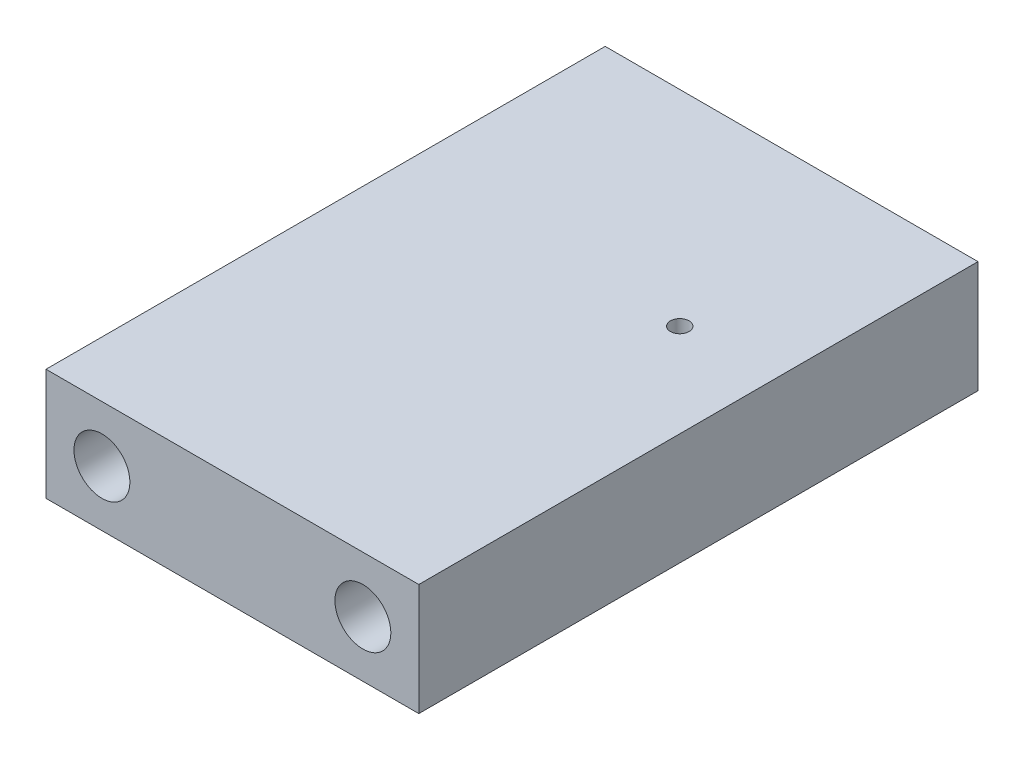
ISO-10303-21;
HEADER;
FILE_DESCRIPTION(('STEP AP214'),'2;1');
FILE_NAME('part.step','',(''),(''),'','','');
FILE_SCHEMA(('AUTOMOTIVE_DESIGN { 1 0 10303 214 1 1 1 1 }'));
ENDSEC;
DATA;
#1=APPLICATION_CONTEXT('core data for automotive mechanical design processes');
#2=APPLICATION_PROTOCOL_DEFINITION('international standard','automotive_design',2000,#1);
#3=PRODUCT_CONTEXT('',#1,'mechanical');
#4=PRODUCT('Part','Part','',(#3));
#5=PRODUCT_RELATED_PRODUCT_CATEGORY('part','',(#4));
#6=PRODUCT_DEFINITION_FORMATION('','',#4);
#7=PRODUCT_DEFINITION_CONTEXT('part definition',#1,'design');
#8=PRODUCT_DEFINITION('design','',#6,#7);
#9=PRODUCT_DEFINITION_SHAPE('','',#8);
#10=(LENGTH_UNIT() NAMED_UNIT(*) SI_UNIT(.MILLI.,.METRE.));
#11=(NAMED_UNIT(*) PLANE_ANGLE_UNIT() SI_UNIT($,.RADIAN.));
#12=(NAMED_UNIT(*) SI_UNIT($,.STERADIAN.) SOLID_ANGLE_UNIT());
#13=UNCERTAINTY_MEASURE_WITH_UNIT(LENGTH_MEASURE(1.E-05),#10,'distance_accuracy_value','');
#14=(GEOMETRIC_REPRESENTATION_CONTEXT(3) GLOBAL_UNCERTAINTY_ASSIGNED_CONTEXT((#13)) GLOBAL_UNIT_ASSIGNED_CONTEXT((#10,
#11,#12)) REPRESENTATION_CONTEXT('',''));
#15=CARTESIAN_POINT('',(0.,0.,0.));
#16=DIRECTION('',(0.,0.,1.));
#17=DIRECTION('',(1.,0.,0.));
#18=AXIS2_PLACEMENT_3D('',#15,#16,#17);
#19=CARTESIAN_POINT('',(0.,0.,30.));
#20=DIRECTION('',(1.,0.,0.));
#21=DIRECTION('',(0.,0.,-1.));
#22=AXIS2_PLACEMENT_3D('',#19,#20,#21);
#23=PLANE('',#22);
#24=DIRECTION('',(0.,-1.,0.));
#25=VECTOR('',#24,1.);
#26=CARTESIAN_POINT('',(0.,0.,0.));
#27=LINE('',#26,#25);
#28=CARTESIAN_POINT('',(0.,6.,0.));
#29=VERTEX_POINT('',#28);
#30=CARTESIAN_POINT('',(0.,0.,0.));
#31=VERTEX_POINT('',#30);
#32=EDGE_CURVE('E96',#29,#31,#27,.T.);
#33=ORIENTED_EDGE('',*,*,#32,.T.);
#34=DIRECTION('',(0.,0.,-1.));
#35=VECTOR('',#34,1.);
#36=CARTESIAN_POINT('',(0.,0.,30.));
#37=LINE('',#36,#35);
#38=CARTESIAN_POINT('',(0.,0.,30.));
#39=VERTEX_POINT('',#38);
#40=EDGE_CURVE('E11',#39,#31,#37,.T.);
#41=ORIENTED_EDGE('',*,*,#40,.F.);
#42=DIRECTION('',(0.,-1.,0.));
#43=VECTOR('',#42,1.);
#44=CARTESIAN_POINT('',(0.,0.,30.));
#45=LINE('',#44,#43);
#46=CARTESIAN_POINT('',(0.,6.,30.));
#47=VERTEX_POINT('',#46);
#48=EDGE_CURVE('E84',#47,#39,#45,.T.);
#49=ORIENTED_EDGE('',*,*,#48,.F.);
#50=DIRECTION('',(0.,0.,-1.));
#51=VECTOR('',#50,1.);
#52=CARTESIAN_POINT('',(0.,6.,30.));
#53=LINE('',#52,#51);
#54=EDGE_CURVE('E92',#47,#29,#53,.T.);
#55=ORIENTED_EDGE('',*,*,#54,.T.);
#56=EDGE_LOOP('',(#33,#41,#49,#55));
#57=FACE_BOUND('',#56,.T.);
#58=ADVANCED_FACE('F33',(#57),#23,.F.);
#59=CARTESIAN_POINT('',(0.,0.,30.));
#60=DIRECTION('',(0.,1.,0.));
#61=DIRECTION('',(0.,0.,1.));
#62=AXIS2_PLACEMENT_3D('',#59,#60,#61);
#63=PLANE('',#62);
#64=CARTESIAN_POINT('',(15.,0.,11.));
#65=DIRECTION('',(0.,1.,0.));
#66=DIRECTION('',(0.,0.,1.));
#67=AXIS2_PLACEMENT_3D('',#64,#65,#66);
#68=CIRCLE('',#67,0.500000000000001);
#69=CARTESIAN_POINT('',(15.,0.,11.5));
#70=VERTEX_POINT('',#69);
#71=EDGE_CURVE('E131',#70,#70,#68,.T.);
#72=ORIENTED_EDGE('',*,*,#71,.T.);
#73=EDGE_LOOP('',(#72));
#74=FACE_BOUND('',#73,.T.);
#75=DIRECTION('',(1.,0.,0.));
#76=VECTOR('',#75,1.);
#77=CARTESIAN_POINT('',(0.,0.,0.));
#78=LINE('',#77,#76);
#79=CARTESIAN_POINT('',(20.,0.,0.));
#80=VERTEX_POINT('',#79);
#81=EDGE_CURVE('E88',#31,#80,#78,.T.);
#82=ORIENTED_EDGE('',*,*,#81,.T.);
#83=DIRECTION('',(0.,0.,-1.));
#84=VECTOR('',#83,1.);
#85=CARTESIAN_POINT('',(20.,0.,30.));
#86=LINE('',#85,#84);
#87=CARTESIAN_POINT('',(20.,0.,30.));
#88=VERTEX_POINT('',#87);
#89=EDGE_CURVE('E41',#88,#80,#86,.T.);
#90=ORIENTED_EDGE('',*,*,#89,.F.);
#91=DIRECTION('',(1.,0.,0.));
#92=VECTOR('',#91,1.);
#93=CARTESIAN_POINT('',(0.,0.,30.));
#94=LINE('',#93,#92);
#95=EDGE_CURVE('E79',#39,#88,#94,.T.);
#96=ORIENTED_EDGE('',*,*,#95,.F.);
#97=ORIENTED_EDGE('',*,*,#40,.T.);
#98=EDGE_LOOP('',(#82,#90,#96,#97));
#99=FACE_BOUND('',#98,.T.);
#100=ADVANCED_FACE('F87',(#74,#99),#63,.F.);
#101=CARTESIAN_POINT('',(20.,0.,30.));
#102=DIRECTION('',(-1.,0.,0.));
#103=DIRECTION('',(0.,0.,1.));
#104=AXIS2_PLACEMENT_3D('',#101,#102,#103);
#105=PLANE('',#104);
#106=DIRECTION('',(0.,1.,0.));
#107=VECTOR('',#106,1.);
#108=CARTESIAN_POINT('',(20.,0.,0.));
#109=LINE('',#108,#107);
#110=CARTESIAN_POINT('',(20.,6.,0.));
#111=VERTEX_POINT('',#110);
#112=EDGE_CURVE('E66',#80,#111,#109,.T.);
#113=ORIENTED_EDGE('',*,*,#112,.T.);
#114=DIRECTION('',(0.,0.,-1.));
#115=VECTOR('',#114,1.);
#116=CARTESIAN_POINT('',(20.,6.,30.));
#117=LINE('',#116,#115);
#118=CARTESIAN_POINT('',(20.,6.,30.));
#119=VERTEX_POINT('',#118);
#120=EDGE_CURVE('E89',#119,#111,#117,.T.);
#121=ORIENTED_EDGE('',*,*,#120,.F.);
#122=DIRECTION('',(0.,1.,0.));
#123=VECTOR('',#122,1.);
#124=CARTESIAN_POINT('',(20.,0.,30.));
#125=LINE('',#124,#123);
#126=EDGE_CURVE('E82',#88,#119,#125,.T.);
#127=ORIENTED_EDGE('',*,*,#126,.F.);
#128=ORIENTED_EDGE('',*,*,#89,.T.);
#129=EDGE_LOOP('',(#113,#121,#127,#128));
#130=FACE_BOUND('',#129,.T.);
#131=ADVANCED_FACE('F90',(#130),#105,.F.);
#132=CARTESIAN_POINT('',(0.,6.,30.));
#133=DIRECTION('',(0.,-1.,0.));
#134=DIRECTION('',(0.,0.,-1.));
#135=AXIS2_PLACEMENT_3D('',#132,#133,#134);
#136=PLANE('',#135);
#137=CARTESIAN_POINT('',(15.,6.,11.));
#138=DIRECTION('',(0.,1.,0.));
#139=DIRECTION('',(0.,0.,1.));
#140=AXIS2_PLACEMENT_3D('',#137,#138,#139);
#141=CIRCLE('',#140,0.500000000000001);
#142=CARTESIAN_POINT('',(15.,6.,11.5));
#143=VERTEX_POINT('',#142);
#144=EDGE_CURVE('E136',#143,#143,#141,.T.);
#145=ORIENTED_EDGE('',*,*,#144,.F.);
#146=EDGE_LOOP('',(#145));
#147=FACE_BOUND('',#146,.T.);
#148=DIRECTION('',(-1.,0.,0.));
#149=VECTOR('',#148,1.);
#150=CARTESIAN_POINT('',(0.,6.,0.));
#151=LINE('',#150,#149);
#152=EDGE_CURVE('E72',#111,#29,#151,.T.);
#153=ORIENTED_EDGE('',*,*,#152,.T.);
#154=ORIENTED_EDGE('',*,*,#54,.F.);
#155=DIRECTION('',(-1.,0.,0.));
#156=VECTOR('',#155,1.);
#157=CARTESIAN_POINT('',(0.,6.,30.));
#158=LINE('',#157,#156);
#159=EDGE_CURVE('E49',#119,#47,#158,.T.);
#160=ORIENTED_EDGE('',*,*,#159,.F.);
#161=ORIENTED_EDGE('',*,*,#120,.T.);
#162=EDGE_LOOP('',(#153,#154,#160,#161));
#163=FACE_BOUND('',#162,.T.);
#164=ADVANCED_FACE('F104',(#147,#163),#136,.F.);
#165=CARTESIAN_POINT('',(0.,0.,30.));
#166=DIRECTION('',(0.,0.,-1.));
#167=DIRECTION('',(-1.,0.,0.));
#168=AXIS2_PLACEMENT_3D('',#165,#166,#167);
#169=PLANE('',#168);
#170=CARTESIAN_POINT('',(17.,3.,30.));
#171=DIRECTION('',(0.,0.,1.));
#172=DIRECTION('',(1.,0.,0.));
#173=AXIS2_PLACEMENT_3D('',#170,#171,#172);
#174=CIRCLE('',#173,1.5);
#175=CARTESIAN_POINT('',(18.5,3.,30.));
#176=VERTEX_POINT('',#175);
#177=EDGE_CURVE('E116',#176,#176,#174,.T.);
#178=ORIENTED_EDGE('',*,*,#177,.F.);
#179=EDGE_LOOP('',(#178));
#180=FACE_BOUND('',#179,.T.);
#181=CARTESIAN_POINT('',(3.,3.,30.));
#182=DIRECTION('',(0.,0.,1.));
#183=DIRECTION('',(1.,0.,0.));
#184=AXIS2_PLACEMENT_3D('',#181,#182,#183);
#185=CIRCLE('',#184,1.5);
#186=CARTESIAN_POINT('',(4.5,3.,30.));
#187=VERTEX_POINT('',#186);
#188=EDGE_CURVE('E110',#187,#187,#185,.T.);
#189=ORIENTED_EDGE('',*,*,#188,.F.);
#190=EDGE_LOOP('',(#189));
#191=FACE_BOUND('',#190,.T.);
#192=ORIENTED_EDGE('',*,*,#48,.T.);
#193=ORIENTED_EDGE('',*,*,#95,.T.);
#194=ORIENTED_EDGE('',*,*,#126,.T.);
#195=ORIENTED_EDGE('',*,*,#159,.T.);
#196=EDGE_LOOP('',(#192,#193,#194,#195));
#197=FACE_BOUND('',#196,.T.);
#198=ADVANCED_FACE('F80',(#180,#191,#197),#169,.F.);
#199=CARTESIAN_POINT('',(0.,0.,0.));
#200=DIRECTION('',(0.,0.,-1.));
#201=DIRECTION('',(-1.,0.,0.));
#202=AXIS2_PLACEMENT_3D('',#199,#200,#201);
#203=PLANE('',#202);
#204=CARTESIAN_POINT('',(3.,3.,0.));
#205=DIRECTION('',(0.,0.,-1.));
#206=DIRECTION('',(-1.,0.,0.));
#207=AXIS2_PLACEMENT_3D('',#204,#205,#206);
#208=CIRCLE('',#207,1.5);
#209=CARTESIAN_POINT('',(1.5,3.,0.));
#210=VERTEX_POINT('',#209);
#211=EDGE_CURVE('E128',#210,#210,#208,.T.);
#212=ORIENTED_EDGE('',*,*,#211,.F.);
#213=EDGE_LOOP('',(#212));
#214=FACE_BOUND('',#213,.T.);
#215=CARTESIAN_POINT('',(17.,3.,0.));
#216=DIRECTION('',(0.,0.,-1.));
#217=DIRECTION('',(-1.,0.,0.));
#218=AXIS2_PLACEMENT_3D('',#215,#216,#217);
#219=CIRCLE('',#218,1.5);
#220=CARTESIAN_POINT('',(15.5,3.,0.));
#221=VERTEX_POINT('',#220);
#222=EDGE_CURVE('E122',#221,#221,#219,.T.);
#223=ORIENTED_EDGE('',*,*,#222,.F.);
#224=EDGE_LOOP('',(#223));
#225=FACE_BOUND('',#224,.T.);
#226=ORIENTED_EDGE('',*,*,#32,.F.);
#227=ORIENTED_EDGE('',*,*,#152,.F.);
#228=ORIENTED_EDGE('',*,*,#112,.F.);
#229=ORIENTED_EDGE('',*,*,#81,.F.);
#230=EDGE_LOOP('',(#226,#227,#228,#229));
#231=FACE_BOUND('',#230,.T.);
#232=ADVANCED_FACE('F107',(#214,#225,#231),#203,.T.);
#233=CARTESIAN_POINT('',(3.,3.,25.));
#234=DIRECTION('',(0.,0.,1.));
#235=DIRECTION('',(1.,0.,0.));
#236=AXIS2_PLACEMENT_3D('',#233,#234,#235);
#237=CYLINDRICAL_SURFACE('',#236,1.5);
#238=CARTESIAN_POINT('',(3.,3.,25.));
#239=DIRECTION('',(0.,0.,1.));
#240=DIRECTION('',(1.,0.,0.));
#241=AXIS2_PLACEMENT_3D('',#238,#239,#240);
#242=CIRCLE('',#241,1.5);
#243=CARTESIAN_POINT('',(4.5,3.,25.));
#244=VERTEX_POINT('',#243);
#245=EDGE_CURVE('E99',#244,#244,#242,.T.);
#246=ORIENTED_EDGE('',*,*,#245,.F.);
#247=EDGE_LOOP('',(#246));
#248=FACE_BOUND('',#247,.T.);
#249=ORIENTED_EDGE('',*,*,#188,.T.);
#250=EDGE_LOOP('',(#249));
#251=FACE_BOUND('',#250,.T.);
#252=ADVANCED_FACE('F194',(#248,#251),#237,.F.);
#253=CARTESIAN_POINT('',(3.,3.,25.));
#254=DIRECTION('',(0.,0.,1.));
#255=DIRECTION('',(1.,0.,0.));
#256=AXIS2_PLACEMENT_3D('',#253,#254,#255);
#257=PLANE('',#256);
#258=ORIENTED_EDGE('',*,*,#245,.T.);
#259=EDGE_LOOP('',(#258));
#260=FACE_BOUND('',#259,.T.);
#261=ADVANCED_FACE('F190',(#260),#257,.T.);
#262=CARTESIAN_POINT('',(17.,3.,25.));
#263=DIRECTION('',(0.,0.,1.));
#264=DIRECTION('',(1.,0.,0.));
#265=AXIS2_PLACEMENT_3D('',#262,#263,#264);
#266=CYLINDRICAL_SURFACE('',#265,1.5);
#267=CARTESIAN_POINT('',(17.,3.,25.));
#268=DIRECTION('',(0.,0.,1.));
#269=DIRECTION('',(1.,0.,0.));
#270=AXIS2_PLACEMENT_3D('',#267,#268,#269);
#271=CIRCLE('',#270,1.5);
#272=CARTESIAN_POINT('',(18.5,3.,25.));
#273=VERTEX_POINT('',#272);
#274=EDGE_CURVE('E113',#273,#273,#271,.T.);
#275=ORIENTED_EDGE('',*,*,#274,.F.);
#276=EDGE_LOOP('',(#275));
#277=FACE_BOUND('',#276,.T.);
#278=ORIENTED_EDGE('',*,*,#177,.T.);
#279=EDGE_LOOP('',(#278));
#280=FACE_BOUND('',#279,.T.);
#281=ADVANCED_FACE('F186',(#277,#280),#266,.F.);
#282=CARTESIAN_POINT('',(17.,3.,25.));
#283=DIRECTION('',(0.,0.,1.));
#284=DIRECTION('',(1.,0.,0.));
#285=AXIS2_PLACEMENT_3D('',#282,#283,#284);
#286=PLANE('',#285);
#287=ORIENTED_EDGE('',*,*,#274,.T.);
#288=EDGE_LOOP('',(#287));
#289=FACE_BOUND('',#288,.T.);
#290=ADVANCED_FACE('F182',(#289),#286,.T.);
#291=CARTESIAN_POINT('',(17.,3.,5.));
#292=DIRECTION('',(0.,0.,-1.));
#293=DIRECTION('',(-1.,0.,0.));
#294=AXIS2_PLACEMENT_3D('',#291,#292,#293);
#295=CYLINDRICAL_SURFACE('',#294,1.5);
#296=CARTESIAN_POINT('',(17.,3.,5.));
#297=DIRECTION('',(0.,0.,-1.));
#298=DIRECTION('',(-1.,0.,0.));
#299=AXIS2_PLACEMENT_3D('',#296,#297,#298);
#300=CIRCLE('',#299,1.5);
#301=CARTESIAN_POINT('',(15.5,3.,5.));
#302=VERTEX_POINT('',#301);
#303=EDGE_CURVE('E119',#302,#302,#300,.T.);
#304=ORIENTED_EDGE('',*,*,#303,.F.);
#305=EDGE_LOOP('',(#304));
#306=FACE_BOUND('',#305,.T.);
#307=ORIENTED_EDGE('',*,*,#222,.T.);
#308=EDGE_LOOP('',(#307));
#309=FACE_BOUND('',#308,.T.);
#310=ADVANCED_FACE('F178',(#306,#309),#295,.F.);
#311=CARTESIAN_POINT('',(17.,3.,5.));
#312=DIRECTION('',(0.,0.,-1.));
#313=DIRECTION('',(-1.,0.,0.));
#314=AXIS2_PLACEMENT_3D('',#311,#312,#313);
#315=PLANE('',#314);
#316=ORIENTED_EDGE('',*,*,#303,.T.);
#317=EDGE_LOOP('',(#316));
#318=FACE_BOUND('',#317,.T.);
#319=ADVANCED_FACE('F174',(#318),#315,.T.);
#320=CARTESIAN_POINT('',(3.,3.,5.));
#321=DIRECTION('',(0.,0.,-1.));
#322=DIRECTION('',(-1.,0.,0.));
#323=AXIS2_PLACEMENT_3D('',#320,#321,#322);
#324=CYLINDRICAL_SURFACE('',#323,1.5);
#325=CARTESIAN_POINT('',(3.,3.,5.));
#326=DIRECTION('',(0.,0.,-1.));
#327=DIRECTION('',(-1.,0.,0.));
#328=AXIS2_PLACEMENT_3D('',#325,#326,#327);
#329=CIRCLE('',#328,1.5);
#330=CARTESIAN_POINT('',(1.5,3.,5.));
#331=VERTEX_POINT('',#330);
#332=EDGE_CURVE('E125',#331,#331,#329,.T.);
#333=ORIENTED_EDGE('',*,*,#332,.F.);
#334=EDGE_LOOP('',(#333));
#335=FACE_BOUND('',#334,.T.);
#336=ORIENTED_EDGE('',*,*,#211,.T.);
#337=EDGE_LOOP('',(#336));
#338=FACE_BOUND('',#337,.T.);
#339=ADVANCED_FACE('F168',(#335,#338),#324,.F.);
#340=CARTESIAN_POINT('',(3.,3.,5.));
#341=DIRECTION('',(0.,0.,-1.));
#342=DIRECTION('',(-1.,0.,0.));
#343=AXIS2_PLACEMENT_3D('',#340,#341,#342);
#344=PLANE('',#343);
#345=ORIENTED_EDGE('',*,*,#332,.T.);
#346=EDGE_LOOP('',(#345));
#347=FACE_BOUND('',#346,.T.);
#348=ADVANCED_FACE('F164',(#347),#344,.T.);
#349=CARTESIAN_POINT('',(15.,-4.,11.));
#350=DIRECTION('',(0.,1.,0.));
#351=DIRECTION('',(0.,0.,1.));
#352=AXIS2_PLACEMENT_3D('',#349,#350,#351);
#353=CYLINDRICAL_SURFACE('',#352,0.500000000000001);
#354=ORIENTED_EDGE('',*,*,#144,.T.);
#355=EDGE_LOOP('',(#354));
#356=FACE_BOUND('',#355,.T.);
#357=ORIENTED_EDGE('',*,*,#71,.F.);
#358=EDGE_LOOP('',(#357));
#359=FACE_BOUND('',#358,.T.);
#360=ADVANCED_FACE('F140',(#356,#359),#353,.F.);
#361=CLOSED_SHELL('',(#58,#100,#131,#164,#198,#232,#252,#261,#281,#290,#310,#319,#339,#348,#360));
#362=MANIFOLD_SOLID_BREP('B2',#361);
#363=ADVANCED_BREP_SHAPE_REPRESENTATION('',(#18,#362),#14);
#364=SHAPE_DEFINITION_REPRESENTATION(#9,#363);
ENDSEC;
END-ISO-10303-21;
